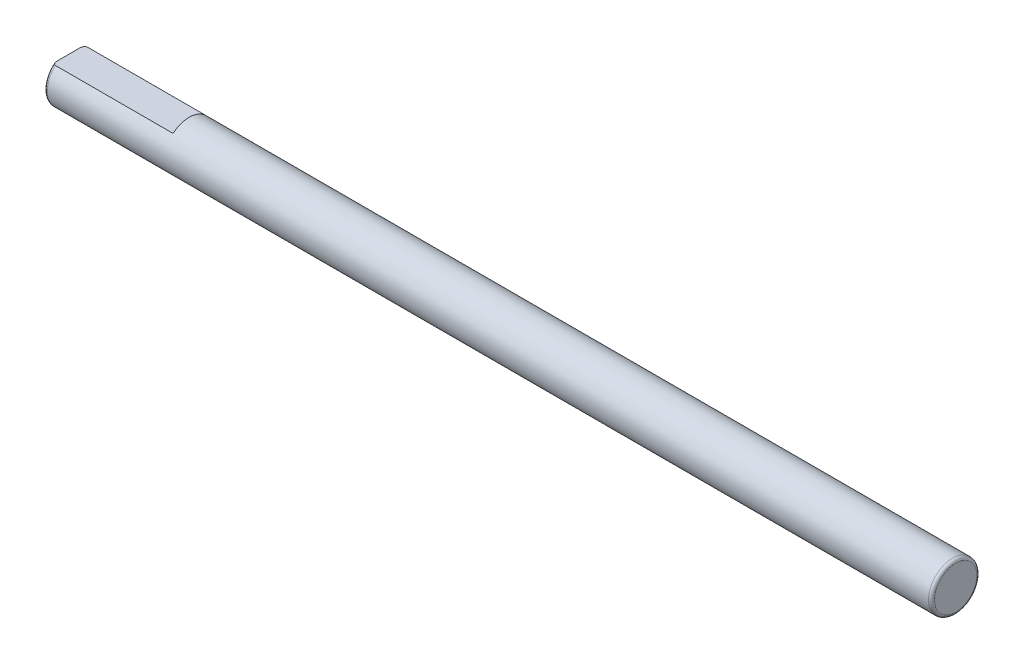
ISO-10303-21;
HEADER;
FILE_DESCRIPTION(('STEP AP214'),'2;1');
FILE_NAME('part.step','',(''),(''),'','','');
FILE_SCHEMA(('AUTOMOTIVE_DESIGN { 1 0 10303 214 1 1 1 1 }'));
ENDSEC;
DATA;
#1=APPLICATION_CONTEXT('core data for automotive mechanical design processes');
#2=APPLICATION_PROTOCOL_DEFINITION('international standard','automotive_design',2000,#1);
#3=PRODUCT_CONTEXT('',#1,'mechanical');
#4=PRODUCT('Part','Part','',(#3));
#5=PRODUCT_RELATED_PRODUCT_CATEGORY('part','',(#4));
#6=PRODUCT_DEFINITION_FORMATION('','',#4);
#7=PRODUCT_DEFINITION_CONTEXT('part definition',#1,'design');
#8=PRODUCT_DEFINITION('design','',#6,#7);
#9=PRODUCT_DEFINITION_SHAPE('','',#8);
#10=(LENGTH_UNIT() NAMED_UNIT(*) SI_UNIT(.MILLI.,.METRE.));
#11=(NAMED_UNIT(*) PLANE_ANGLE_UNIT() SI_UNIT($,.RADIAN.));
#12=(NAMED_UNIT(*) SI_UNIT($,.STERADIAN.) SOLID_ANGLE_UNIT());
#13=UNCERTAINTY_MEASURE_WITH_UNIT(LENGTH_MEASURE(1.E-05),#10,'distance_accuracy_value','');
#14=(GEOMETRIC_REPRESENTATION_CONTEXT(3) GLOBAL_UNCERTAINTY_ASSIGNED_CONTEXT((#13)) GLOBAL_UNIT_ASSIGNED_CONTEXT((#10,
#11,#12)) REPRESENTATION_CONTEXT('',''));
#15=CARTESIAN_POINT('',(0.,0.,0.));
#16=DIRECTION('',(0.,0.,1.));
#17=DIRECTION('',(1.,0.,0.));
#18=AXIS2_PLACEMENT_3D('',#15,#16,#17);
#19=CARTESIAN_POINT('',(147.,0.,0.));
#20=DIRECTION('',(-1.,0.,0.));
#21=DIRECTION('',(0.,0.,1.));
#22=AXIS2_PLACEMENT_3D('',#19,#20,#21);
#23=CYLINDRICAL_SURFACE('',#22,4.);
#24=CARTESIAN_POINT('',(146.5,0.,0.));
#25=DIRECTION('',(1.,0.,0.));
#26=DIRECTION('',(0.,0.,-1.));
#27=AXIS2_PLACEMENT_3D('',#24,#25,#26);
#28=CIRCLE('',#27,4.);
#29=CARTESIAN_POINT('',(146.5,0.,-4.));
#30=VERTEX_POINT('',#29);
#31=EDGE_CURVE('E78',#30,#30,#28,.F.);
#32=ORIENTED_EDGE('',*,*,#31,.T.);
#33=EDGE_LOOP('',(#32));
#34=FACE_BOUND('',#33,.T.);
#35=CARTESIAN_POINT('',(20.,0.,0.));
#36=DIRECTION('',(-1.,0.,0.));
#37=DIRECTION('',(0.,0.,1.));
#38=AXIS2_PLACEMENT_3D('',#35,#36,#37);
#39=CIRCLE('',#38,4.);
#40=CARTESIAN_POINT('',(20.,3.,2.64575131106459));
#41=VERTEX_POINT('',#40);
#42=CARTESIAN_POINT('',(20.,3.,-2.64575131106459));
#43=VERTEX_POINT('',#42);
#44=EDGE_CURVE('E11',#41,#43,#39,.T.);
#45=ORIENTED_EDGE('',*,*,#44,.F.);
#46=DIRECTION('',(-1.,0.,0.));
#47=VECTOR('',#46,1.);
#48=CARTESIAN_POINT('',(147.,3.,2.64575131106459));
#49=LINE('',#48,#47);
#50=CARTESIAN_POINT('',(0.499999999999951,3.,2.64575131106459));
#51=VERTEX_POINT('',#50);
#52=EDGE_CURVE('E120',#41,#51,#49,.T.);
#53=ORIENTED_EDGE('',*,*,#52,.T.);
#54=CARTESIAN_POINT('',(0.5,0.,0.));
#55=DIRECTION('',(1.,0.,0.));
#56=DIRECTION('',(0.,0.,-1.));
#57=AXIS2_PLACEMENT_3D('',#54,#55,#56);
#58=CIRCLE('',#57,4.);
#59=CARTESIAN_POINT('',(0.50000000000005,3.,-2.64575131106459));
#60=VERTEX_POINT('',#59);
#61=EDGE_CURVE('E82',#51,#60,#58,.T.);
#62=ORIENTED_EDGE('',*,*,#61,.T.);
#63=DIRECTION('',(-1.,0.,0.));
#64=VECTOR('',#63,1.);
#65=CARTESIAN_POINT('',(147.,3.,-2.64575131106459));
#66=LINE('',#65,#64);
#67=EDGE_CURVE('E56',#60,#43,#66,.F.);
#68=ORIENTED_EDGE('',*,*,#67,.T.);
#69=EDGE_LOOP('',(#45,#53,#62,#68));
#70=FACE_BOUND('',#69,.T.);
#71=ADVANCED_FACE('F34',(#34,#70),#23,.T.);
#72=CARTESIAN_POINT('',(147.,0.,0.));
#73=DIRECTION('',(1.,0.,0.));
#74=DIRECTION('',(0.,0.,-1.));
#75=AXIS2_PLACEMENT_3D('',#72,#73,#74);
#76=PLANE('',#75);
#77=CARTESIAN_POINT('',(147.,0.,0.));
#78=DIRECTION('',(1.,0.,0.));
#79=DIRECTION('',(0.,0.,-1.));
#80=AXIS2_PLACEMENT_3D('',#77,#78,#79);
#81=CIRCLE('',#80,3.5);
#82=CARTESIAN_POINT('',(147.,0.,-3.5));
#83=VERTEX_POINT('',#82);
#84=EDGE_CURVE('E118',#83,#83,#81,.T.);
#85=ORIENTED_EDGE('',*,*,#84,.T.);
#86=EDGE_LOOP('',(#85));
#87=FACE_BOUND('',#86,.T.);
#88=ADVANCED_FACE('F99',(#87),#76,.T.);
#89=CARTESIAN_POINT('',(0.,0.,0.));
#90=DIRECTION('',(1.,0.,0.));
#91=DIRECTION('',(0.,0.,-1.));
#92=AXIS2_PLACEMENT_3D('',#89,#90,#91);
#93=PLANE('',#92);
#94=CARTESIAN_POINT('',(0.,0.,0.));
#95=DIRECTION('',(1.,0.,0.));
#96=DIRECTION('',(0.,0.,-1.));
#97=AXIS2_PLACEMENT_3D('',#94,#95,#96);
#98=CIRCLE('',#97,3.5);
#99=CARTESIAN_POINT('',(0.,3.,-1.802775637732));
#100=VERTEX_POINT('',#99);
#101=CARTESIAN_POINT('',(0.,3.,1.802775637732));
#102=VERTEX_POINT('',#101);
#103=EDGE_CURVE('E75',#100,#102,#98,.F.);
#104=ORIENTED_EDGE('',*,*,#103,.T.);
#105=DIRECTION('',(0.,0.,1.));
#106=VECTOR('',#105,1.);
#107=CARTESIAN_POINT('',(0.,3.,-3.0891487911814));
#108=LINE('',#107,#106);
#109=EDGE_CURVE('E50',#100,#102,#108,.T.);
#110=ORIENTED_EDGE('',*,*,#109,.F.);
#111=EDGE_LOOP('',(#104,#110));
#112=FACE_BOUND('',#111,.T.);
#113=ADVANCED_FACE('F74',(#112),#93,.F.);
#114=CARTESIAN_POINT('',(146.5,0.,0.));
#115=DIRECTION('',(1.,0.,0.));
#116=DIRECTION('',(0.,0.,-1.));
#117=AXIS2_PLACEMENT_3D('',#114,#115,#116);
#118=TOROIDAL_SURFACE('',#117,3.5,0.5);
#119=ORIENTED_EDGE('',*,*,#31,.F.);
#120=EDGE_LOOP('',(#119));
#121=FACE_BOUND('',#120,.T.);
#122=ORIENTED_EDGE('',*,*,#84,.F.);
#123=EDGE_LOOP('',(#122));
#124=FACE_BOUND('',#123,.T.);
#125=ADVANCED_FACE('F106',(#121,#124),#118,.T.);
#126=CARTESIAN_POINT('',(0.5,0.,0.));
#127=DIRECTION('',(1.,0.,0.));
#128=DIRECTION('',(0.,0.,-1.));
#129=AXIS2_PLACEMENT_3D('',#126,#127,#128);
#130=TOROIDAL_SURFACE('',#129,3.5,0.5);
#131=CARTESIAN_POINT('',(0.5,3.,0.));
#132=CARTESIAN_POINT('',(0.500000809088146,3.,-3.2934607506314E-10));
#133=CARTESIAN_POINT('',(0.500001618108411,3.,-1.67667279640265E-07));
#134=CARTESIAN_POINT('',(0.500003176606055,3.,-6.9945231536977E-07));
#135=CARTESIAN_POINT('',(0.500003923981369,3.,-1.06892420157277E-06));
#136=CARTESIAN_POINT('',(0.500005413740321,3.,-1.9570834816732E-06));
#137=CARTESIAN_POINT('',(0.500006149872059,3.,-2.48605601121779E-06));
#138=CARTESIAN_POINT('',(0.50000754034948,3.,-3.62802522910673E-06));
#139=CARTESIAN_POINT('',(0.500008195307211,3.,-4.24030942558303E-06));
#140=CARTESIAN_POINT('',(0.500010385105272,3.,-6.43180846500297E-06));
#141=CARTESIAN_POINT('',(0.500011811987412,3.,-8.12039536722845E-06));
#142=CARTESIAN_POINT('',(0.500014359628101,3.,-1.16140419291981E-05));
#143=CARTESIAN_POINT('',(0.500015489395678,3.,-1.34129078724813E-05));
#144=CARTESIAN_POINT('',(0.50001971989055,3.,-2.04163342887109E-05));
#145=CARTESIAN_POINT('',(0.500022598011228,3.,-2.57614968734041E-05));
#146=CARTESIAN_POINT('',(0.500027318652184,3.,-3.63150304880423E-05));
#147=CARTESIAN_POINT('',(0.50002923041933,3.,-4.14934293805156E-05));
#148=CARTESIAN_POINT('',(0.500037327276918,3.,-6.35047206306328E-05));
#149=CARTESIAN_POINT('',(0.500043450710295,3.,-8.03491167271492E-05));
#150=CARTESIAN_POINT('',(0.500053306845904,3.,-0.000111903145406854));
#151=CARTESIAN_POINT('',(0.500057262814986,3.,-0.000126540106854419));
#152=CARTESIAN_POINT('',(0.500088519055675,3.,-0.000232715488464067));
#153=CARTESIAN_POINT('',(0.500128266452262,3.,-0.000320029134275242));
#154=CARTESIAN_POINT('',(0.500276959950626,3.,-0.000659124701096024));
#155=CARTESIAN_POINT('',(0.500376660339702,3.,-0.000913839636284209));
#156=CARTESIAN_POINT('',(0.500769024539738,3.,-0.00190151482622701));
#157=CARTESIAN_POINT('',(0.50107137796929,3.,-0.00263146538292722));
#158=CARTESIAN_POINT('',(0.502303116986653,3.,-0.00561938141922183));
#159=CARTESIAN_POINT('',(0.503221567826035,3.,-0.00788067423083214));
#160=CARTESIAN_POINT('',(0.521363727066382,3.,-0.0525294961269583));
#161=CARTESIAN_POINT('',(0.538706292206086,3.,-0.0948814603897114));
#162=CARTESIAN_POINT('',(0.572537841038551,3.,-0.178106178364997));
#163=CARTESIAN_POINT('',(0.589034737743194,3.,-0.218975962780763));
#164=CARTESIAN_POINT('',(0.623682560408479,3.,-0.305580211857914));
#165=CARTESIAN_POINT('',(0.641802551140837,3.,-0.35132729187215));
#166=CARTESIAN_POINT('',(0.677703045345115,3.,-0.443490069714424));
#167=CARTESIAN_POINT('',(0.695478237205682,3.,-0.489907841384319));
#168=CARTESIAN_POINT('',(0.725749928723063,3.,-0.570834253560249));
#169=CARTESIAN_POINT('',(0.738410736434121,3.,-0.605281249358845));
#170=CARTESIAN_POINT('',(0.763222224720536,3.,-0.674264199384321));
#171=CARTESIAN_POINT('',(0.775374066081844,3.,-0.708799736354263));
#172=CARTESIAN_POINT('',(0.810446908527797,3.,-0.811138279206476));
#173=CARTESIAN_POINT('',(0.832571047185817,3.,-0.879218053507057));
#174=CARTESIAN_POINT('',(0.876921950991112,3.,-1.02618826213861));
#175=CARTESIAN_POINT('',(0.898699659227395,3.,-1.10521659285786));
#176=CARTESIAN_POINT('',(0.937294199860766,3.,-1.26517799044851));
#177=CARTESIAN_POINT('',(0.954069937301385,3.,-1.346121239105));
#178=CARTESIAN_POINT('',(0.981496647216805,3.,-1.51404150066003));
#179=CARTESIAN_POINT('',(0.991723486153632,3.,-1.60109082141265));
#180=CARTESIAN_POINT('',(1.0016304665507,3.,-1.77557216985603));
#181=CARTESIAN_POINT('',(1.00135814278864,3.,-1.86300068112729));
#182=CARTESIAN_POINT('',(0.988651759554046,3.,-2.01061403624832));
#183=CARTESIAN_POINT('',(0.979893031996419,3.,-2.07109870196367));
#184=CARTESIAN_POINT('',(0.953502893424042,3.,-2.18949411855467));
#185=CARTESIAN_POINT('',(0.935986358665715,3.,-2.24742789116418));
#186=CARTESIAN_POINT('',(0.900039704312819,3.,-2.33381307952221));
#187=CARTESIAN_POINT('',(0.885506746912705,3.,-2.36388244266121));
#188=CARTESIAN_POINT('',(0.85245040783283,3.,-2.42185524072283));
#189=CARTESIAN_POINT('',(0.833922633916885,3.,-2.44975624526212));
#190=CARTESIAN_POINT('',(0.7965825454489,3.,-2.49689419782548));
#191=CARTESIAN_POINT('',(0.778559028637205,3.,-2.51675087661283));
#192=CARTESIAN_POINT('',(0.739572103071065,3.,-2.55333362983963));
#193=CARTESIAN_POINT('',(0.718614464165329,3.,-2.57006570152396));
#194=CARTESIAN_POINT('',(0.67891078425283,3.,-2.59602672464035));
#195=CARTESIAN_POINT('',(0.660717264579315,3.,-2.60609681859337));
#196=CARTESIAN_POINT('',(0.622912563737041,3.,-2.623112296613));
#197=CARTESIAN_POINT('',(0.603302253722279,3.,-2.63005958216399));
#198=CARTESIAN_POINT('',(0.56301476320006,3.,-2.64036273771542));
#199=CARTESIAN_POINT('',(0.542331701205913,3.,-2.64369598136285));
#200=CARTESIAN_POINT('',(0.500707916843597,3.,-2.64640559948722));
#201=CARTESIAN_POINT('',(0.479767281713323,3.,-2.64578327874975));
#202=CARTESIAN_POINT('',(0.440427583184487,3.,-2.64089905702711));
#203=CARTESIAN_POINT('',(0.421981538311264,3.,-2.63700214813721));
#204=CARTESIAN_POINT('',(0.385956215176315,3.,-2.62631149761408));
#205=CARTESIAN_POINT('',(0.36837708063967,3.,-2.61951727742486));
#206=CARTESIAN_POINT('',(0.333556054029368,3.,-2.60301019185976));
#207=CARTESIAN_POINT('',(0.316376843936938,3.,-2.5931663991519));
#208=CARTESIAN_POINT('',(0.283553635483454,3.,-2.57120495735787));
#209=CARTESIAN_POINT('',(0.267910319926095,3.,-2.55908630385892));
#210=CARTESIAN_POINT('',(0.229405446050632,3.,-2.52528761959886));
#211=CARTESIAN_POINT('',(0.207773904467145,3.,-2.50220323171021));
#212=CARTESIAN_POINT('',(0.168418923512549,3.,-2.45289119290977));
#213=CARTESIAN_POINT('',(0.150708217228096,3.,-2.42665371575611));
#214=CARTESIAN_POINT('',(0.110266308186318,3.,-2.35741023828566));
#215=CARTESIAN_POINT('',(0.0899740483454385,3.,-2.31298826255613));
#216=CARTESIAN_POINT('',(0.0564099001066308,3.,-2.22176394892125));
#217=CARTESIAN_POINT('',(0.043130411782171,3.,-2.17496424838651));
#218=CARTESIAN_POINT('',(0.0237633730551337,3.,-2.08697565597443));
#219=CARTESIAN_POINT('',(0.0169163061931374,3.,-2.04594747659781));
#220=CARTESIAN_POINT('',(0.00675967641004121,3.,-1.9634385868835));
#221=CARTESIAN_POINT('',(0.00345312236565857,3.,-1.9219575218554));
#222=CARTESIAN_POINT('',(-0.00201025293698873,3.,-1.79591946738754));
#223=CARTESIAN_POINT('',(0.000554770585140939,3.,-1.71115993553401));
#224=CARTESIAN_POINT('',(0.0174300288954169,3.,-1.51140251574389));
#225=CARTESIAN_POINT('',(0.0357272025744261,3.,-1.39679487716935));
#226=CARTESIAN_POINT('',(0.0838375443384744,3.,-1.16962376031828));
#227=CARTESIAN_POINT('',(0.113705882630573,3.,-1.05707282200538));
#228=CARTESIAN_POINT('',(0.178080307857804,3.,-0.844082202523085));
#229=CARTESIAN_POINT('',(0.21195188804201,3.,-0.74344452314468));
#230=CARTESIAN_POINT('',(0.283327157203447,3.,-0.544693937069991));
#231=CARTESIAN_POINT('',(0.320788645994851,3.,-0.446565585026118));
#232=CARTESIAN_POINT('',(0.368707849371471,3.,-0.324872681130772));
#233=CARTESIAN_POINT('',(0.3782096425379,3.,-0.300922641925631));
#234=CARTESIAN_POINT('',(0.39756530065873,3.,-0.252430502986033));
#235=CARTESIAN_POINT('',(0.407421839456958,3.,-0.227889458246371));
#236=CARTESIAN_POINT('',(0.43092611634603,3.,-0.169596396492738));
#237=CARTESIAN_POINT('',(0.444603443763393,3.,-0.135856755555247));
#238=CARTESIAN_POINT('',(0.470842624326647,3.,-0.0714698247451515));
#239=CARTESIAN_POINT('',(0.483393596859186,3.,-0.0408185928270958));
#240=CARTESIAN_POINT('',(0.496776257167533,3.,-0.00788623845360394));
#241=CARTESIAN_POINT('',(0.497692413042641,3.,-0.00563047352138915));
#242=CARTESIAN_POINT('',(0.49892354895344,3.,-0.0026439047168306));
#243=CARTESIAN_POINT('',(0.499227629346511,3.,-0.00190978863955239));
#244=CARTESIAN_POINT('',(0.499622097652642,3.,-0.000916812623804387));
#245=CARTESIAN_POINT('',(0.49972223716506,3.,-0.000660978772585737));
#246=CARTESIAN_POINT('',(0.499871515509436,3.,-0.000320570794487707));
#247=CARTESIAN_POINT('',(0.499911357741668,3.,-0.000233049169458826));
#248=CARTESIAN_POINT('',(0.499942667595315,3.,-0.000126636222343927));
#249=CARTESIAN_POINT('',(0.49994662572238,3.,-0.00011198349258714));
#250=CARTESIAN_POINT('',(0.499956493457853,3.,-8.03948799674941E-05));
#251=CARTESIAN_POINT('',(0.499962627668005,3.,-6.35320960836763E-05));
#252=CARTESIAN_POINT('',(0.499970738141426,3.,-4.15001682322679E-05));
#253=CARTESIAN_POINT('',(0.499972652283502,3.,-3.63192959757123E-05));
#254=CARTESIAN_POINT('',(0.499977379167323,3.,-2.57611213342259E-05));
#255=CARTESIAN_POINT('',(0.499980261301865,3.,-2.04138799617288E-05));
#256=CARTESIAN_POINT('',(0.499984497373793,3.,-1.34085100346821E-05));
#257=CARTESIAN_POINT('',(0.499985628444553,3.,-1.16094520804406E-05));
#258=CARTESIAN_POINT('',(0.499988178909839,3.,-8.11568090045751E-06));
#259=CARTESIAN_POINT('',(0.499989607322178,3.,-6.42717404158496E-06));
#260=CARTESIAN_POINT('',(0.499991799264343,3.,-4.23609541338912E-06));
#261=CARTESIAN_POINT('',(0.499992454809909,3.,-3.62399400351353E-06));
#262=CARTESIAN_POINT('',(0.499993846467545,3.,-2.48249549911878E-06));
#263=CARTESIAN_POINT('',(0.499994583191879,3.,-1.95381202778724E-06));
#264=CARTESIAN_POINT('',(0.499996074032542,3.,-1.06635169280823E-06));
#265=CARTESIAN_POINT('',(0.499996821897943,3.,-6.97275834581454E-07));
#266=CARTESIAN_POINT('',(0.499998381265326,3.,-1.66450950331506E-07));
#267=CARTESIAN_POINT('',(0.499999190666624,3.,3.29445898566957E-10));
#268=CARTESIAN_POINT('',(0.5,3.,0.));
#269=B_SPLINE_CURVE_WITH_KNOTS('',3,(#131,#132,#133,#134,#135,#136,#137,#138,#139,#140,#141,
#142,#143,#144,#145,#146,#147,#148,#149,#150,#151,#152,#153,#154,#155,#156,#157,#158,#159,#160,
#161,#162,#163,#164,#165,#166,#167,#168,#169,#170,#171,#172,#173,#174,#175,#176,#177,#178,#179,
#180,#181,#182,#183,#184,#185,#186,#187,#188,#189,#190,#191,#192,#193,#194,#195,#196,#197,#198,
#199,#200,#201,#202,#203,#204,#205,#206,#207,#208,#209,#210,#211,#212,#213,#214,#215,#216,#217,
#218,#219,#220,#221,#222,#223,#224,#225,#226,#227,#228,#229,#230,#231,#232,#233,#234,#235,#236,
#237,#238,#239,#240,#241,#242,#243,#244,#245,#246,#247,#248,#249,#250,#251,#252,#253,#254,#255,
#256,#257,#258,#259,#260,#261,#262,#263,#264,#265,#266,#267,#268),.UNSPECIFIED.,.T.,.F.,(4,2,2,
2,2,2,2,2,2,2,2,2,2,2,2,2,2,2,2,2,2,2,2,2,2,2,2,2,2,2,2,2,2,2,2,2,2,2,2,2,2,2,2,2,2,2,2,2,2,2,2,
2,2,2,2,2,2,2,2,2,2,2,2,2,2,2,2,2,4),(0.,2.42577140557126E-06,4.91478110570216E-06,
7.62327817523988E-06,1.03099186208152E-05,1.69098728522729E-05,2.32774624627675E-05,
4.14315821071887E-05,5.79742803822167E-05,0.000111731604111281,0.000157176209987339,
0.000443854285448882,0.00126537151567835,0.00363449825944129,0.0109577843232788,
0.14823796152855,0.280462080852896,0.428073969058702,0.577183919440007,0.687280760477523,
0.797111062900995,1.01181718035164,1.25761408968685,1.50537803059263,1.76789367938719,
2.02922093329222,2.21210120104423,2.39264319721214,2.4926047048953,2.59267668424855,
2.67285452731945,2.75287686200225,2.81501496252162,2.87711517560124,2.93960197229294,
3.00206815811057,3.05837386128685,3.11468886821825,3.17386957128519,3.23307646596263,
3.32744250264447,3.42211064246199,3.56780261152902,3.71333636463611,3.83794603621182,
3.96266152248216,4.21629845213776,4.56358436079346,4.9125468888076,5.23097433673934,
5.5460342126434,5.62333278485183,5.70267125442574,5.81189399554254,5.9112473332884,
5.91855267841801,5.92093532155446,5.92176045135823,5.92204781085149,5.92209330261594,
5.92214712248503,5.92216367456895,5.92218183971372,5.92218820986477,5.92219481255307,
5.922197500105,5.92220020952932,5.92220269932133,5.92220512582798),.UNSPECIFIED.);
#270=EDGE_CURVE('E43',#60,#100,#269,.T.);
#271=ORIENTED_EDGE('',*,*,#270,.F.);
#272=ORIENTED_EDGE('',*,*,#61,.F.);
#273=CARTESIAN_POINT('',(0.5,3.,0.));
#274=CARTESIAN_POINT('',(0.499999190911855,3.,3.29346080531089E-10));
#275=CARTESIAN_POINT('',(0.49999838189159,3.,1.67667279645256E-07));
#276=CARTESIAN_POINT('',(0.499996823393946,3.,6.99452315387634E-07));
#277=CARTESIAN_POINT('',(0.499996076018632,3.,1.06892420161261E-06));
#278=CARTESIAN_POINT('',(0.49999458625968,3.,1.95708348167848E-06));
#279=CARTESIAN_POINT('',(0.499993850127941,3.,2.48605601116866E-06));
#280=CARTESIAN_POINT('',(0.49999245965052,3.,3.62802522906312E-06));
#281=CARTESIAN_POINT('',(0.499991804692789,3.,4.24030942558021E-06));
#282=CARTESIAN_POINT('',(0.499989614894729,3.,6.43180846513845E-06));
#283=CARTESIAN_POINT('',(0.499988188012589,3.,8.12039536717703E-06));
#284=CARTESIAN_POINT('',(0.499985640371899,3.,1.16140419290538E-05));
#285=CARTESIAN_POINT('',(0.499984510604323,3.,1.34129078724051E-05));
#286=CARTESIAN_POINT('',(0.499980280109451,3.,2.04163342888789E-05));
#287=CARTESIAN_POINT('',(0.499977401988773,3.,2.57614968734216E-05));
#288=CARTESIAN_POINT('',(0.499972681347817,3.,3.63150304879688E-05));
#289=CARTESIAN_POINT('',(0.499970769580671,3.,4.14934293804847E-05));
#290=CARTESIAN_POINT('',(0.499962672723083,3.,6.35047206307141E-05));
#291=CARTESIAN_POINT('',(0.499956549289706,3.,8.03491167271915E-05));
#292=CARTESIAN_POINT('',(0.499946693154097,3.,0.000111903145406862));
#293=CARTESIAN_POINT('',(0.499942737185014,3.,0.000126540106854423));
#294=CARTESIAN_POINT('',(0.499911480944326,3.,0.000232715488464098));
#295=CARTESIAN_POINT('',(0.499871733547738,3.,0.000320029134275249));
#296=CARTESIAN_POINT('',(0.499723040049375,3.,0.000659124701095968));
#297=CARTESIAN_POINT('',(0.499623339660299,3.,0.00091383963628417));
#298=CARTESIAN_POINT('',(0.499230975460263,3.,0.00190151482622701));
#299=CARTESIAN_POINT('',(0.498928622030711,3.,0.00263146538292719));
#300=CARTESIAN_POINT('',(0.497696883013348,3.,0.00561938141922179));
#301=CARTESIAN_POINT('',(0.496778432173966,3.,0.00788067423083212));
#302=CARTESIAN_POINT('',(0.478636272933618,3.,0.0525294961269583));
#303=CARTESIAN_POINT('',(0.461293707793911,3.,0.0948814603897104));
#304=CARTESIAN_POINT('',(0.427462158961447,3.,0.178106178364996));
#305=CARTESIAN_POINT('',(0.410965262256806,3.,0.218975962780763));
#306=CARTESIAN_POINT('',(0.376317439591523,3.,0.305580211857916));
#307=CARTESIAN_POINT('',(0.358197448859163,3.,0.351327291872151));
#308=CARTESIAN_POINT('',(0.322296954654884,3.,0.443490069714426));
#309=CARTESIAN_POINT('',(0.304521762794318,3.,0.489907841384323));
#310=CARTESIAN_POINT('',(0.274250071276937,3.,0.570834253560253));
#311=CARTESIAN_POINT('',(0.261589263565879,3.,0.605281249358848));
#312=CARTESIAN_POINT('',(0.236777775279463,3.,0.674264199384323));
#313=CARTESIAN_POINT('',(0.224625933918156,3.,0.708799736354265));
#314=CARTESIAN_POINT('',(0.189553091472204,3.,0.811138279206477));
#315=CARTESIAN_POINT('',(0.167428952814184,3.,0.879218053507057));
#316=CARTESIAN_POINT('',(0.123078049008889,3.,1.02618826213861));
#317=CARTESIAN_POINT('',(0.101300340772606,3.,1.10521659285786));
#318=CARTESIAN_POINT('',(0.0627058001392351,3.,1.26517799044851));
#319=CARTESIAN_POINT('',(0.0459300626986163,3.,1.346121239105));
#320=CARTESIAN_POINT('',(0.0185033527831959,3.,1.51404150066003));
#321=CARTESIAN_POINT('',(0.00827651384636933,3.,1.60109082141265));
#322=CARTESIAN_POINT('',(-0.00163046655070144,3.,1.77557216985603));
#323=CARTESIAN_POINT('',(-0.0013581427886383,3.,1.86300068112729));
#324=CARTESIAN_POINT('',(0.0113482404459548,3.,2.01061403624832));
#325=CARTESIAN_POINT('',(0.020106968003582,3.,2.07109870196367));
#326=CARTESIAN_POINT('',(0.0464971065759595,3.,2.18949411855468));
#327=CARTESIAN_POINT('',(0.0640136413342866,3.,2.24742789116418));
#328=CARTESIAN_POINT('',(0.0999602956871824,3.,2.33381307952221));
#329=CARTESIAN_POINT('',(0.114493253087296,3.,2.36388244266121));
#330=CARTESIAN_POINT('',(0.147549592167171,3.,2.42185524072283));
#331=CARTESIAN_POINT('',(0.166077366083116,3.,2.44975624526212));
#332=CARTESIAN_POINT('',(0.203417454551101,3.,2.49689419782548));
#333=CARTESIAN_POINT('',(0.221440971362795,3.,2.51675087661283));
#334=CARTESIAN_POINT('',(0.260427896928936,3.,2.55333362983963));
#335=CARTESIAN_POINT('',(0.281385535834672,3.,2.57006570152396));
#336=CARTESIAN_POINT('',(0.321089215747171,3.,2.59602672464035));
#337=CARTESIAN_POINT('',(0.339282735420686,3.,2.60609681859337));
#338=CARTESIAN_POINT('',(0.37708743626296,3.,2.623112296613));
#339=CARTESIAN_POINT('',(0.396697746277722,3.,2.63005958216399));
#340=CARTESIAN_POINT('',(0.43698523679994,3.,2.64036273771542));
#341=CARTESIAN_POINT('',(0.457668298794088,3.,2.64369598136285));
#342=CARTESIAN_POINT('',(0.499292083156404,3.,2.64640559948722));
#343=CARTESIAN_POINT('',(0.520232718286677,3.,2.64578327874975));
#344=CARTESIAN_POINT('',(0.559572416815514,3.,2.64089905702711));
#345=CARTESIAN_POINT('',(0.578018461688736,3.,2.63700214813721));
#346=CARTESIAN_POINT('',(0.614043784823686,3.,2.62631149761408));
#347=CARTESIAN_POINT('',(0.631622919360331,3.,2.61951727742486));
#348=CARTESIAN_POINT('',(0.666443945970632,3.,2.60301019185976));
#349=CARTESIAN_POINT('',(0.683623156063063,3.,2.5931663991519));
#350=CARTESIAN_POINT('',(0.716446364516547,3.,2.57120495735787));
#351=CARTESIAN_POINT('',(0.732089680073906,3.,2.55908630385892));
#352=CARTESIAN_POINT('',(0.770594553949369,3.,2.52528761959886));
#353=CARTESIAN_POINT('',(0.792226095532856,3.,2.50220323171021));
#354=CARTESIAN_POINT('',(0.831581076487452,3.,2.45289119290977));
#355=CARTESIAN_POINT('',(0.849291782771905,3.,2.42665371575611));
#356=CARTESIAN_POINT('',(0.889733691813683,3.,2.35741023828566));
#357=CARTESIAN_POINT('',(0.910025951654562,3.,2.31298826255613));
#358=CARTESIAN_POINT('',(0.94359009989337,3.,2.22176394892125));
#359=CARTESIAN_POINT('',(0.95686958821783,3.,2.17496424838651));
#360=CARTESIAN_POINT('',(0.976236626944867,3.,2.08697565597443));
#361=CARTESIAN_POINT('',(0.983083693806863,3.,2.04594747659781));
#362=CARTESIAN_POINT('',(0.993240323589959,3.,1.9634385868835));
#363=CARTESIAN_POINT('',(0.996546877634342,3.,1.9219575218554));
#364=CARTESIAN_POINT('',(1.00201025293699,3.,1.79591946738754));
#365=CARTESIAN_POINT('',(0.99944522941486,3.,1.71115993553401));
#366=CARTESIAN_POINT('',(0.982569971104584,3.,1.5114025157439));
#367=CARTESIAN_POINT('',(0.964272797425575,3.,1.39679487716935));
#368=CARTESIAN_POINT('',(0.916162455661528,3.,1.16962376031828));
#369=CARTESIAN_POINT('',(0.88629411736943,3.,1.05707282200538));
#370=CARTESIAN_POINT('',(0.821919692142198,3.,0.844082202523089));
#371=CARTESIAN_POINT('',(0.788048111957992,3.,0.743444523144685));
#372=CARTESIAN_POINT('',(0.716672842796557,3.,0.544693937069997));
#373=CARTESIAN_POINT('',(0.679211354005154,3.,0.446565585026125));
#374=CARTESIAN_POINT('',(0.631292150628532,3.,0.32487268113078));
#375=CARTESIAN_POINT('',(0.621790357462102,3.,0.300922641925638));
#376=CARTESIAN_POINT('',(0.602434699341271,3.,0.252430502986038));
#377=CARTESIAN_POINT('',(0.592578160543043,3.,0.227889458246376));
#378=CARTESIAN_POINT('',(0.569073883653971,3.,0.169596396492741));
#379=CARTESIAN_POINT('',(0.555396556236608,3.,0.135856755555249));
#380=CARTESIAN_POINT('',(0.529157375673355,3.,0.0714698247451526));
#381=CARTESIAN_POINT('',(0.516606403140817,3.,0.0408185928270963));
#382=CARTESIAN_POINT('',(0.503223742832466,3.,0.00788623845360452));
#383=CARTESIAN_POINT('',(0.502307586957358,3.,0.00563047352138977));
#384=CARTESIAN_POINT('',(0.501076451046561,3.,0.00264390471683072));
#385=CARTESIAN_POINT('',(0.500772370653491,3.,0.00190978863955234));
#386=CARTESIAN_POINT('',(0.500377902347358,3.,0.000916812623804518));
#387=CARTESIAN_POINT('',(0.50027776283494,3.,0.000660978772585944));
#388=CARTESIAN_POINT('',(0.500128484490565,3.,0.000320570794487669));
#389=CARTESIAN_POINT('',(0.500088642258334,3.,0.00023304916945869));
#390=CARTESIAN_POINT('',(0.500057332404686,3.,0.000126636222343655));
#391=CARTESIAN_POINT('',(0.500053374277621,3.,0.000111983492586593));
#392=CARTESIAN_POINT('',(0.500043506542147,3.,8.03948799666229E-05));
#393=CARTESIAN_POINT('',(0.500037372331995,3.,6.35320960827373E-05));
#394=CARTESIAN_POINT('',(0.500029261858575,3.,4.15001682315285E-05));
#395=CARTESIAN_POINT('',(0.500027347716499,3.,3.63192959751632E-05));
#396=CARTESIAN_POINT('',(0.500022620832677,3.,2.57611213340422E-05));
#397=CARTESIAN_POINT('',(0.500019738698135,3.,2.04138799617154E-05));
#398=CARTESIAN_POINT('',(0.500015502626208,3.,1.34085100348346E-05));
#399=CARTESIAN_POINT('',(0.500014371555448,3.,1.16094520805854E-05));
#400=CARTESIAN_POINT('',(0.500011821090162,3.,8.11568090056396E-06));
#401=CARTESIAN_POINT('',(0.500010392677823,3.,6.42717404166035E-06));
#402=CARTESIAN_POINT('',(0.500008200735658,3.,4.23609541366498E-06));
#403=CARTESIAN_POINT('',(0.500007545190092,3.,3.62399400398315E-06));
#404=CARTESIAN_POINT('',(0.500006153532457,3.,2.48249549970985E-06));
#405=CARTESIAN_POINT('',(0.500005416808123,3.,1.95381202833283E-06));
#406=CARTESIAN_POINT('',(0.500003925967459,3.,1.06635169308962E-06));
#407=CARTESIAN_POINT('',(0.500003178102058,3.,6.97275834686607E-07));
#408=CARTESIAN_POINT('',(0.500001618734675,3.,1.66450950329229E-07));
#409=CARTESIAN_POINT('',(0.500000809333377,3.,-3.29445904050994E-10));
#410=CARTESIAN_POINT('',(0.5,3.,0.));
#411=B_SPLINE_CURVE_WITH_KNOTS('',3,(#273,#274,#275,#276,#277,#278,#279,#280,#281,#282,#283,
#284,#285,#286,#287,#288,#289,#290,#291,#292,#293,#294,#295,#296,#297,#298,#299,#300,#301,#302,
#303,#304,#305,#306,#307,#308,#309,#310,#311,#312,#313,#314,#315,#316,#317,#318,#319,#320,#321,
#322,#323,#324,#325,#326,#327,#328,#329,#330,#331,#332,#333,#334,#335,#336,#337,#338,#339,#340,
#341,#342,#343,#344,#345,#346,#347,#348,#349,#350,#351,#352,#353,#354,#355,#356,#357,#358,#359,
#360,#361,#362,#363,#364,#365,#366,#367,#368,#369,#370,#371,#372,#373,#374,#375,#376,#377,#378,
#379,#380,#381,#382,#383,#384,#385,#386,#387,#388,#389,#390,#391,#392,#393,#394,#395,#396,#397,
#398,#399,#400,#401,#402,#403,#404,#405,#406,#407,#408,#409,#410),.UNSPECIFIED.,.T.,.F.,(4,2,2,
2,2,2,2,2,2,2,2,2,2,2,2,2,2,2,2,2,2,2,2,2,2,2,2,2,2,2,2,2,2,2,2,2,2,2,2,2,2,2,2,2,2,2,2,2,2,2,2,
2,2,2,2,2,2,2,2,2,2,2,2,2,2,2,2,2,4),(0.,2.42577140546556E-06,4.91478110559445E-06,
7.623278175403E-06,1.03099186207141E-05,1.69098728524453E-05,2.32774624627459E-05,
4.14315821071879E-05,5.79742803822458E-05,0.000111731604111342,0.000157176209987366,
0.000443854285448902,0.00126537151567835,0.00363449825944123,0.0109577843232789,
0.14823796152855,0.280462080852897,0.428073969058704,0.577183919440011,0.687280760477526,
0.797111062900997,1.01181718035164,1.25761408968685,1.50537803059262,1.76789367938719,
2.02922093329222,2.21210120104423,2.39264319721214,2.4926047048953,2.59267668424855,
2.67285452731945,2.75287686200225,2.81501496252162,2.87711517560124,2.93960197229294,
3.00206815811057,3.05837386128685,3.11468886821825,3.17386957128519,3.23307646596263,
3.32744250264447,3.42211064246199,3.56780261152902,3.71333636463611,3.83794603621182,
3.96266152248216,4.21629845213776,4.56358436079346,4.9125468888076,5.23097433673933,
5.54603421264339,5.62333278485183,5.70267125442574,5.81189399554254,5.9112473332884,
5.91855267841802,5.92093532155446,5.92176045135823,5.92204781085149,5.92209330261594,
5.92214712248503,5.92216367456895,5.92218183971372,5.92218820986477,5.92219481255307,
5.922197500105,5.92220020952932,5.92220269932133,5.92220512582798),.UNSPECIFIED.);
#412=EDGE_CURVE('E71',#102,#51,#411,.T.);
#413=ORIENTED_EDGE('',*,*,#412,.F.);
#414=ORIENTED_EDGE('',*,*,#103,.F.);
#415=EDGE_LOOP('',(#271,#272,#413,#414));
#416=FACE_BOUND('',#415,.T.);
#417=ADVANCED_FACE('F36',(#416),#130,.T.);
#418=CARTESIAN_POINT('',(20.,0.,0.));
#419=DIRECTION('',(-1.,0.,0.));
#420=DIRECTION('',(0.,0.,1.));
#421=AXIS2_PLACEMENT_3D('',#418,#419,#420);
#422=PLANE('',#421);
#423=ORIENTED_EDGE('',*,*,#44,.T.);
#424=DIRECTION('',(0.,0.,1.));
#425=VECTOR('',#424,1.);
#426=CARTESIAN_POINT('',(20.,3.,-3.0891487911814));
#427=LINE('',#426,#425);
#428=EDGE_CURVE('E76',#43,#41,#427,.T.);
#429=ORIENTED_EDGE('',*,*,#428,.T.);
#430=EDGE_LOOP('',(#423,#429));
#431=FACE_BOUND('',#430,.T.);
#432=ADVANCED_FACE('F98',(#431),#422,.T.);
#433=CARTESIAN_POINT('',(20.,3.,-3.0891487911814));
#434=DIRECTION('',(0.,-1.,0.));
#435=DIRECTION('',(0.,0.,-1.));
#436=AXIS2_PLACEMENT_3D('',#433,#434,#435);
#437=PLANE('',#436);
#438=ORIENTED_EDGE('',*,*,#270,.T.);
#439=ORIENTED_EDGE('',*,*,#109,.T.);
#440=ORIENTED_EDGE('',*,*,#412,.T.);
#441=ORIENTED_EDGE('',*,*,#52,.F.);
#442=ORIENTED_EDGE('',*,*,#428,.F.);
#443=ORIENTED_EDGE('',*,*,#67,.F.);
#444=EDGE_LOOP('',(#438,#439,#440,#441,#442,#443));
#445=FACE_BOUND('',#444,.T.);
#446=ADVANCED_FACE('F66',(#445),#437,.F.);
#447=CLOSED_SHELL('',(#71,#88,#113,#125,#417,#432,#446));
#448=MANIFOLD_SOLID_BREP('B2',#447);
#449=ADVANCED_BREP_SHAPE_REPRESENTATION('',(#18,#448),#14);
#450=SHAPE_DEFINITION_REPRESENTATION(#9,#449);
ENDSEC;
END-ISO-10303-21;
